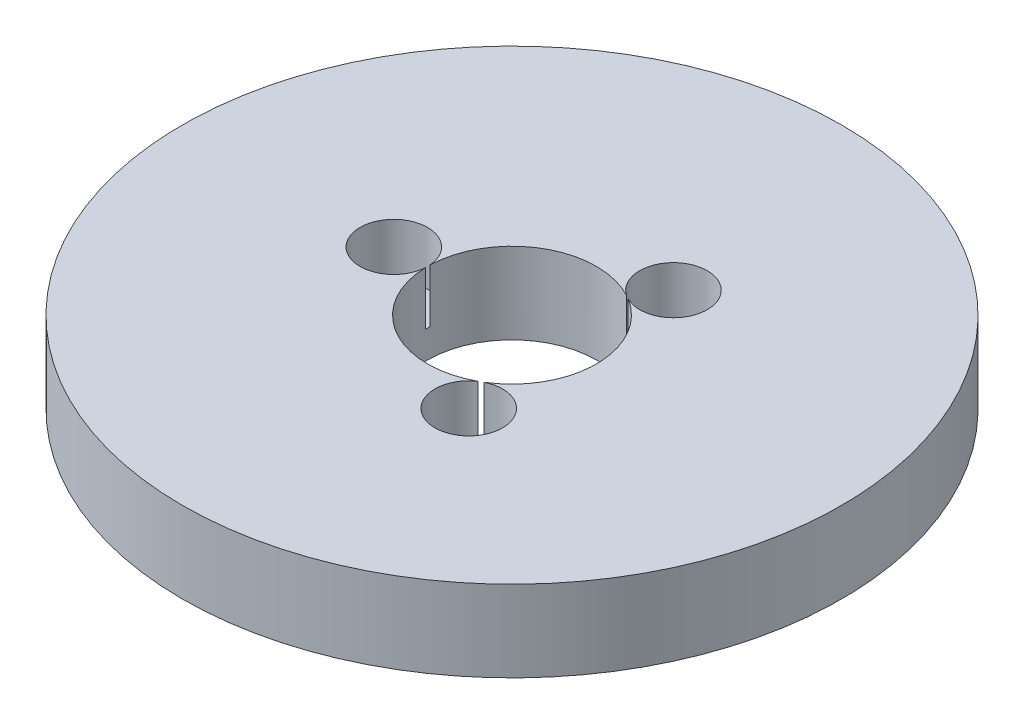
ISO-10303-21;
HEADER;
FILE_DESCRIPTION(('STEP AP214'),'2;1');
FILE_NAME('part.step','',(''),(''),'','','');
FILE_SCHEMA(('AUTOMOTIVE_DESIGN { 1 0 10303 214 1 1 1 1 }'));
ENDSEC;
DATA;
#1=APPLICATION_CONTEXT('core data for automotive mechanical design processes');
#2=APPLICATION_PROTOCOL_DEFINITION('international standard','automotive_design',2000,#1);
#3=PRODUCT_CONTEXT('',#1,'mechanical');
#4=PRODUCT('Part','Part','',(#3));
#5=PRODUCT_RELATED_PRODUCT_CATEGORY('part','',(#4));
#6=PRODUCT_DEFINITION_FORMATION('','',#4);
#7=PRODUCT_DEFINITION_CONTEXT('part definition',#1,'design');
#8=PRODUCT_DEFINITION('design','',#6,#7);
#9=PRODUCT_DEFINITION_SHAPE('','',#8);
#10=(LENGTH_UNIT() NAMED_UNIT(*) SI_UNIT(.MILLI.,.METRE.));
#11=(NAMED_UNIT(*) PLANE_ANGLE_UNIT() SI_UNIT($,.RADIAN.));
#12=(NAMED_UNIT(*) SI_UNIT($,.STERADIAN.) SOLID_ANGLE_UNIT());
#13=UNCERTAINTY_MEASURE_WITH_UNIT(LENGTH_MEASURE(1.E-05),#10,'distance_accuracy_value','');
#14=(GEOMETRIC_REPRESENTATION_CONTEXT(3) GLOBAL_UNCERTAINTY_ASSIGNED_CONTEXT((#13)) GLOBAL_UNIT_ASSIGNED_CONTEXT((#10,
#11,#12)) REPRESENTATION_CONTEXT('',''));
#15=CARTESIAN_POINT('',(0.,0.,0.));
#16=DIRECTION('',(0.,0.,1.));
#17=DIRECTION('',(1.,0.,0.));
#18=AXIS2_PLACEMENT_3D('',#15,#16,#17);
#19=CARTESIAN_POINT('',(0.,24.,0.));
#20=DIRECTION('',(0.,-1.,0.));
#21=DIRECTION('',(0.,0.,-1.));
#22=AXIS2_PLACEMENT_3D('',#19,#20,#21);
#23=CYLINDRICAL_SURFACE('',#22,97.5);
#24=CARTESIAN_POINT('',(0.,24.,0.));
#25=DIRECTION('',(0.,1.,0.));
#26=DIRECTION('',(0.,0.,1.));
#27=AXIS2_PLACEMENT_3D('',#24,#25,#26);
#28=CIRCLE('',#27,97.5);
#29=CARTESIAN_POINT('',(0.,24.,97.5));
#30=VERTEX_POINT('',#29);
#31=EDGE_CURVE('E126',#30,#30,#28,.T.);
#32=ORIENTED_EDGE('',*,*,#31,.F.);
#33=EDGE_LOOP('',(#32));
#34=FACE_BOUND('',#33,.T.);
#35=CARTESIAN_POINT('',(0.,0.,0.));
#36=DIRECTION('',(0.,1.,0.));
#37=DIRECTION('',(0.,0.,1.));
#38=AXIS2_PLACEMENT_3D('',#35,#36,#37);
#39=CIRCLE('',#38,97.5);
#40=CARTESIAN_POINT('',(0.,0.,97.5));
#41=VERTEX_POINT('',#40);
#42=EDGE_CURVE('E124',#41,#41,#39,.T.);
#43=ORIENTED_EDGE('',*,*,#42,.T.);
#44=EDGE_LOOP('',(#43));
#45=FACE_BOUND('',#44,.T.);
#46=ADVANCED_FACE('F39',(#34,#45),#23,.T.);
#47=CARTESIAN_POINT('',(0.,24.,0.));
#48=DIRECTION('',(0.,1.,0.));
#49=DIRECTION('',(0.,0.,1.));
#50=AXIS2_PLACEMENT_3D('',#47,#48,#49);
#51=PLANE('',#50);
#52=CARTESIAN_POINT('',(17.484623891496,24.,30.2842569313035));
#53=DIRECTION('',(0.,1.,0.));
#54=DIRECTION('',(0.866025403784436,0.,-0.500000000000004));
#55=AXIS2_PLACEMENT_3D('',#52,#53,#54);
#56=CIRCLE('',#55,10.);
#57=CARTESIAN_POINT('',(11.9218389505368,24.,21.9742976233022));
#58=VERTEX_POINT('',#57);
#59=CARTESIAN_POINT('',(13.0693804968315,24.,21.3117642026427));
#60=VERTEX_POINT('',#59);
#61=EDGE_CURVE('E147',#58,#60,#56,.T.);
#62=ORIENTED_EDGE('',*,*,#61,.F.);
#63=CARTESIAN_POINT('',(0.,24.,0.));
#64=DIRECTION('',(0.,1.,0.));
#65=DIRECTION('',(0.,0.,1.));
#66=AXIS2_PLACEMENT_3D('',#63,#64,#65);
#67=CIRCLE('',#66,25.);
#68=CARTESIAN_POINT('',(-24.9912194473681,24.,0.662533420659576));
#69=VERTEX_POINT('',#68);
#70=EDGE_CURVE('E118',#69,#58,#67,.T.);
#71=ORIENTED_EDGE('',*,*,#70,.F.);
#72=CARTESIAN_POINT('',(-34.9692477829918,24.,0.));
#73=DIRECTION('',(0.,1.,0.));
#74=DIRECTION('',(0.,0.,1.));
#75=AXIS2_PLACEMENT_3D('',#72,#73,#74);
#76=CIRCLE('',#75,10.);
#77=CARTESIAN_POINT('',(-24.9912194473681,24.,-0.662533420659576));
#78=VERTEX_POINT('',#77);
#79=EDGE_CURVE('E113',#78,#69,#76,.T.);
#80=ORIENTED_EDGE('',*,*,#79,.F.);
#81=CARTESIAN_POINT('',(11.9218389505364,24.,-21.9742976233024));
#82=VERTEX_POINT('',#81);
#83=EDGE_CURVE('E106',#82,#78,#67,.T.);
#84=ORIENTED_EDGE('',*,*,#83,.F.);
#85=CARTESIAN_POINT('',(17.4846238914956,24.,-30.2842569313037));
#86=DIRECTION('',(0.,1.,0.));
#87=DIRECTION('',(-0.866025403784443,0.,-0.499999999999992));
#88=AXIS2_PLACEMENT_3D('',#85,#86,#87);
#89=CIRCLE('',#88,10.);
#90=CARTESIAN_POINT('',(13.0693804968312,24.,-21.3117642026428));
#91=VERTEX_POINT('',#90);
#92=EDGE_CURVE('E90',#91,#82,#89,.T.);
#93=ORIENTED_EDGE('',*,*,#92,.F.);
#94=EDGE_CURVE('E116',#60,#91,#67,.T.);
#95=ORIENTED_EDGE('',*,*,#94,.F.);
#96=EDGE_LOOP('',(#62,#71,#80,#84,#93,#95));
#97=FACE_BOUND('',#96,.T.);
#98=ORIENTED_EDGE('',*,*,#31,.T.);
#99=EDGE_LOOP('',(#98));
#100=FACE_BOUND('',#99,.T.);
#101=ADVANCED_FACE('F115',(#97,#100),#51,.T.);
#102=CARTESIAN_POINT('',(0.,0.,0.));
#103=DIRECTION('',(0.,1.,0.));
#104=DIRECTION('',(0.,0.,1.));
#105=AXIS2_PLACEMENT_3D('',#102,#103,#104);
#106=PLANE('',#105);
#107=CARTESIAN_POINT('',(0.,0.,0.));
#108=DIRECTION('',(0.,1.,0.));
#109=DIRECTION('',(0.,0.,1.));
#110=AXIS2_PLACEMENT_3D('',#107,#108,#109);
#111=CIRCLE('',#110,25.);
#112=CARTESIAN_POINT('',(0.,0.,25.));
#113=VERTEX_POINT('',#112);
#114=EDGE_CURVE('E120',#113,#113,#111,.T.);
#115=ORIENTED_EDGE('',*,*,#114,.T.);
#116=EDGE_LOOP('',(#115));
#117=FACE_BOUND('',#116,.T.);
#118=ORIENTED_EDGE('',*,*,#42,.F.);
#119=EDGE_LOOP('',(#118));
#120=FACE_BOUND('',#119,.T.);
#121=ADVANCED_FACE('F164',(#117,#120),#106,.F.);
#122=CARTESIAN_POINT('',(0.,24.,0.));
#123=DIRECTION('',(0.,-1.,0.));
#124=DIRECTION('',(0.,0.,-1.));
#125=AXIS2_PLACEMENT_3D('',#122,#123,#124);
#126=CYLINDRICAL_SURFACE('',#125,25.);
#127=DIRECTION('',(0.,1.,0.));
#128=VECTOR('',#127,1.);
#129=CARTESIAN_POINT('',(11.9218389505368,16.0881192874875,21.9742976233022));
#130=LINE('',#129,#128);
#131=CARTESIAN_POINT('',(11.9218389505368,8.17623857497495,21.9742976233022));
#132=VERTEX_POINT('',#131);
#133=EDGE_CURVE('E11',#132,#58,#130,.T.);
#134=ORIENTED_EDGE('',*,*,#133,.F.);
#135=CARTESIAN_POINT('',(0.,8.17623857497495,0.));
#136=DIRECTION('',(0.,1.,0.));
#137=DIRECTION('',(0.,0.,1.));
#138=AXIS2_PLACEMENT_3D('',#135,#136,#137);
#139=CIRCLE('',#138,25.);
#140=CARTESIAN_POINT('',(13.0693804968315,8.17623857497495,21.3117642026427));
#141=VERTEX_POINT('',#140);
#142=EDGE_CURVE('E144',#132,#141,#139,.T.);
#143=ORIENTED_EDGE('',*,*,#142,.T.);
#144=DIRECTION('',(0.,1.,0.));
#145=VECTOR('',#144,1.);
#146=CARTESIAN_POINT('',(13.0693804968315,16.0881192874875,21.3117642026426));
#147=LINE('',#146,#145);
#148=EDGE_CURVE('E46',#60,#141,#147,.F.);
#149=ORIENTED_EDGE('',*,*,#148,.F.);
#150=ORIENTED_EDGE('',*,*,#94,.T.);
#151=DIRECTION('',(0.,1.,0.));
#152=VECTOR('',#151,1.);
#153=CARTESIAN_POINT('',(13.0693804968312,16.0881192874875,-21.3117642026428));
#154=LINE('',#153,#152);
#155=CARTESIAN_POINT('',(13.0693804968312,8.17623857497495,-21.3117642026428));
#156=VERTEX_POINT('',#155);
#157=EDGE_CURVE('E92',#156,#91,#154,.T.);
#158=ORIENTED_EDGE('',*,*,#157,.F.);
#159=CARTESIAN_POINT('',(0.,8.17623857497495,0.));
#160=DIRECTION('',(0.,1.,0.));
#161=DIRECTION('',(0.,0.,1.));
#162=AXIS2_PLACEMENT_3D('',#159,#160,#161);
#163=CIRCLE('',#162,25.);
#164=CARTESIAN_POINT('',(11.9218389505364,8.17623857497495,-21.9742976233024));
#165=VERTEX_POINT('',#164);
#166=EDGE_CURVE('E107',#156,#165,#163,.T.);
#167=ORIENTED_EDGE('',*,*,#166,.T.);
#168=DIRECTION('',(0.,1.,0.));
#169=VECTOR('',#168,1.);
#170=CARTESIAN_POINT('',(11.9218389505365,16.0881192874875,-21.9742976233024));
#171=LINE('',#170,#169);
#172=EDGE_CURVE('E95',#82,#165,#171,.F.);
#173=ORIENTED_EDGE('',*,*,#172,.F.);
#174=ORIENTED_EDGE('',*,*,#83,.T.);
#175=DIRECTION('',(0.,1.,0.));
#176=VECTOR('',#175,1.);
#177=CARTESIAN_POINT('',(-24.9912194473681,16.0881192874875,-0.662533420659555));
#178=LINE('',#177,#176);
#179=CARTESIAN_POINT('',(-24.9912194473681,8.17623857497495,-0.662533420659576));
#180=VERTEX_POINT('',#179);
#181=EDGE_CURVE('E143',#180,#78,#178,.T.);
#182=ORIENTED_EDGE('',*,*,#181,.F.);
#183=CARTESIAN_POINT('',(0.,8.17623857497495,0.));
#184=DIRECTION('',(0.,1.,0.));
#185=DIRECTION('',(0.,0.,1.));
#186=AXIS2_PLACEMENT_3D('',#183,#184,#185);
#187=CIRCLE('',#186,25.);
#188=CARTESIAN_POINT('',(-24.9912194473681,8.17623857497495,0.662533420659576));
#189=VERTEX_POINT('',#188);
#190=EDGE_CURVE('E132',#180,#189,#187,.T.);
#191=ORIENTED_EDGE('',*,*,#190,.T.);
#192=DIRECTION('',(0.,1.,0.));
#193=VECTOR('',#192,1.);
#194=CARTESIAN_POINT('',(-24.9912194473681,16.0881192874875,0.662533420659555));
#195=LINE('',#194,#193);
#196=EDGE_CURVE('E137',#69,#189,#195,.F.);
#197=ORIENTED_EDGE('',*,*,#196,.F.);
#198=ORIENTED_EDGE('',*,*,#70,.T.);
#199=EDGE_LOOP('',(#134,#143,#149,#150,#158,#167,#173,#174,#182,#191,#197,#198));
#200=FACE_BOUND('',#199,.T.);
#201=ORIENTED_EDGE('',*,*,#114,.F.);
#202=EDGE_LOOP('',(#201));
#203=FACE_BOUND('',#202,.T.);
#204=ADVANCED_FACE('F103',(#200,#203),#126,.F.);
#205=CARTESIAN_POINT('',(-34.9692477829918,8.17623857497495,0.));
#206=DIRECTION('',(0.,1.,0.));
#207=DIRECTION('',(0.,0.,1.));
#208=AXIS2_PLACEMENT_3D('',#205,#206,#207);
#209=CYLINDRICAL_SURFACE('',#208,10.);
#210=ORIENTED_EDGE('',*,*,#181,.T.);
#211=ORIENTED_EDGE('',*,*,#79,.T.);
#212=ORIENTED_EDGE('',*,*,#196,.T.);
#213=CARTESIAN_POINT('',(-34.9692477829918,8.17623857497495,0.));
#214=DIRECTION('',(0.,1.,0.));
#215=DIRECTION('',(0.,0.,1.));
#216=AXIS2_PLACEMENT_3D('',#213,#214,#215);
#217=CIRCLE('',#216,10.);
#218=EDGE_CURVE('E121',#180,#189,#217,.T.);
#219=ORIENTED_EDGE('',*,*,#218,.F.);
#220=EDGE_LOOP('',(#210,#211,#212,#219));
#221=FACE_BOUND('',#220,.T.);
#222=ADVANCED_FACE('F174',(#221),#209,.F.);
#223=CARTESIAN_POINT('',(-34.9692477829918,8.17623857497495,0.));
#224=DIRECTION('',(0.,1.,0.));
#225=DIRECTION('',(0.,0.,1.));
#226=AXIS2_PLACEMENT_3D('',#223,#224,#225);
#227=PLANE('',#226);
#228=ORIENTED_EDGE('',*,*,#218,.T.);
#229=ORIENTED_EDGE('',*,*,#190,.F.);
#230=EDGE_LOOP('',(#228,#229));
#231=FACE_BOUND('',#230,.T.);
#232=ADVANCED_FACE('F177',(#231),#227,.T.);
#233=CARTESIAN_POINT('',(17.4846238914956,8.17623857497495,-30.2842569313037));
#234=DIRECTION('',(0.,1.,0.));
#235=DIRECTION('',(0.,0.,1.));
#236=AXIS2_PLACEMENT_3D('',#233,#234,#235);
#237=CYLINDRICAL_SURFACE('',#236,10.);
#238=ORIENTED_EDGE('',*,*,#157,.T.);
#239=ORIENTED_EDGE('',*,*,#92,.T.);
#240=ORIENTED_EDGE('',*,*,#172,.T.);
#241=CARTESIAN_POINT('',(17.4846238914956,8.17623857497495,-30.2842569313037));
#242=DIRECTION('',(0.,1.,0.));
#243=DIRECTION('',(-0.866025403784443,0.,-0.499999999999992));
#244=AXIS2_PLACEMENT_3D('',#241,#242,#243);
#245=CIRCLE('',#244,10.);
#246=EDGE_CURVE('E56',#156,#165,#245,.T.);
#247=ORIENTED_EDGE('',*,*,#246,.F.);
#248=EDGE_LOOP('',(#238,#239,#240,#247));
#249=FACE_BOUND('',#248,.T.);
#250=ADVANCED_FACE('F93',(#249),#237,.F.);
#251=CARTESIAN_POINT('',(17.4846238914956,8.17623857497495,-30.2842569313037));
#252=DIRECTION('',(0.,1.,0.));
#253=DIRECTION('',(-0.866025403784443,0.,-0.499999999999992));
#254=AXIS2_PLACEMENT_3D('',#251,#252,#253);
#255=PLANE('',#254);
#256=ORIENTED_EDGE('',*,*,#246,.T.);
#257=ORIENTED_EDGE('',*,*,#166,.F.);
#258=EDGE_LOOP('',(#256,#257));
#259=FACE_BOUND('',#258,.T.);
#260=ADVANCED_FACE('F160',(#259),#255,.T.);
#261=CARTESIAN_POINT('',(17.484623891496,8.17623857497495,30.2842569313035));
#262=DIRECTION('',(0.,1.,0.));
#263=DIRECTION('',(0.,0.,1.));
#264=AXIS2_PLACEMENT_3D('',#261,#262,#263);
#265=CYLINDRICAL_SURFACE('',#264,10.);
#266=ORIENTED_EDGE('',*,*,#133,.T.);
#267=ORIENTED_EDGE('',*,*,#61,.T.);
#268=ORIENTED_EDGE('',*,*,#148,.T.);
#269=CARTESIAN_POINT('',(17.484623891496,8.17623857497495,30.2842569313035));
#270=DIRECTION('',(0.,1.,0.));
#271=DIRECTION('',(0.866025403784436,0.,-0.500000000000004));
#272=AXIS2_PLACEMENT_3D('',#269,#270,#271);
#273=CIRCLE('',#272,10.);
#274=EDGE_CURVE('E55',#132,#141,#273,.T.);
#275=ORIENTED_EDGE('',*,*,#274,.F.);
#276=EDGE_LOOP('',(#266,#267,#268,#275));
#277=FACE_BOUND('',#276,.T.);
#278=ADVANCED_FACE('F149',(#277),#265,.F.);
#279=CARTESIAN_POINT('',(17.484623891496,8.17623857497495,30.2842569313035));
#280=DIRECTION('',(0.,1.,0.));
#281=DIRECTION('',(0.866025403784436,0.,-0.500000000000004));
#282=AXIS2_PLACEMENT_3D('',#279,#280,#281);
#283=PLANE('',#282);
#284=ORIENTED_EDGE('',*,*,#274,.T.);
#285=ORIENTED_EDGE('',*,*,#142,.F.);
#286=EDGE_LOOP('',(#284,#285));
#287=FACE_BOUND('',#286,.T.);
#288=ADVANCED_FACE('F151',(#287),#283,.T.);
#289=CLOSED_SHELL('',(#46,#101,#121,#204,#222,#232,#250,#260,#278,#288));
#290=MANIFOLD_SOLID_BREP('B2',#289);
#291=ADVANCED_BREP_SHAPE_REPRESENTATION('',(#18,#290),#14);
#292=SHAPE_DEFINITION_REPRESENTATION(#9,#291);
ENDSEC;
END-ISO-10303-21;
